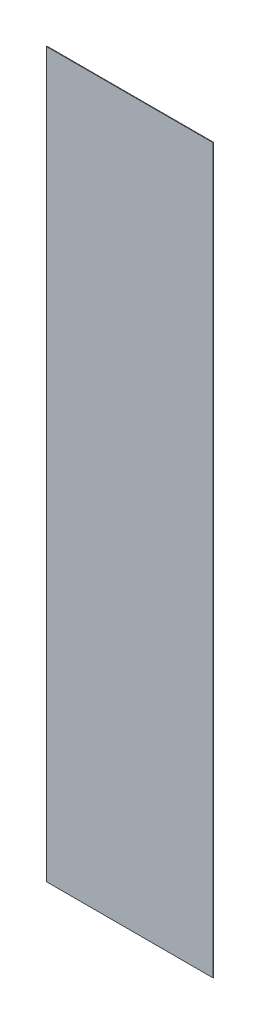
ISO-10303-21;
HEADER;
FILE_DESCRIPTION(('STEP AP214'),'2;1');
FILE_NAME('part.step','',(''),(''),'','','');
FILE_SCHEMA(('AUTOMOTIVE_DESIGN { 1 0 10303 214 1 1 1 1 }'));
ENDSEC;
DATA;
#1=APPLICATION_CONTEXT('core data for automotive mechanical design processes');
#2=APPLICATION_PROTOCOL_DEFINITION('international standard','automotive_design',2000,#1);
#3=PRODUCT_CONTEXT('',#1,'mechanical');
#4=PRODUCT('Part','Part','',(#3));
#5=PRODUCT_RELATED_PRODUCT_CATEGORY('part','',(#4));
#6=PRODUCT_DEFINITION_FORMATION('','',#4);
#7=PRODUCT_DEFINITION_CONTEXT('part definition',#1,'design');
#8=PRODUCT_DEFINITION('design','',#6,#7);
#9=PRODUCT_DEFINITION_SHAPE('','',#8);
#10=(LENGTH_UNIT() NAMED_UNIT(*) SI_UNIT(.MILLI.,.METRE.));
#11=(NAMED_UNIT(*) PLANE_ANGLE_UNIT() SI_UNIT($,.RADIAN.));
#12=(NAMED_UNIT(*) SI_UNIT($,.STERADIAN.) SOLID_ANGLE_UNIT());
#13=UNCERTAINTY_MEASURE_WITH_UNIT(LENGTH_MEASURE(1.E-05),#10,'distance_accuracy_value','');
#14=(GEOMETRIC_REPRESENTATION_CONTEXT(3) GLOBAL_UNCERTAINTY_ASSIGNED_CONTEXT((#13)) GLOBAL_UNIT_ASSIGNED_CONTEXT((#10,
#11,#12)) REPRESENTATION_CONTEXT('',''));
#15=CARTESIAN_POINT('',(0.,0.,0.));
#16=DIRECTION('',(0.,0.,1.));
#17=DIRECTION('',(1.,0.,0.));
#18=AXIS2_PLACEMENT_3D('',#15,#16,#17);
#19=CARTESIAN_POINT('',(1.49999954,-6.4999997,0.00999998));
#20=DIRECTION('',(0.,0.,1.));
#21=DIRECTION('',(1.,0.,0.));
#22=AXIS2_PLACEMENT_3D('',#19,#20,#21);
#23=PLANE('',#22);
#24=DIRECTION('',(0.,-1.,0.));
#25=VECTOR('',#24,1.);
#26=CARTESIAN_POINT('',(1.49999954,6.4999997,0.00999998));
#27=LINE('',#26,#25);
#28=CARTESIAN_POINT('',(1.49999954,6.4999997,0.00999998));
#29=VERTEX_POINT('',#28);
#30=CARTESIAN_POINT('',(1.49999954,-6.4999997,0.00999998));
#31=VERTEX_POINT('',#30);
#32=EDGE_CURVE('E21',#29,#31,#27,.T.);
#33=ORIENTED_EDGE('',*,*,#32,.F.);
#34=DIRECTION('',(1.,0.,0.));
#35=VECTOR('',#34,1.);
#36=CARTESIAN_POINT('',(-1.49999954,6.4999997,0.00999998));
#37=LINE('',#36,#35);
#38=CARTESIAN_POINT('',(-1.49999954,6.4999997,0.00999998));
#39=VERTEX_POINT('',#38);
#40=EDGE_CURVE('E66',#39,#29,#37,.T.);
#41=ORIENTED_EDGE('',*,*,#40,.F.);
#42=DIRECTION('',(0.,1.,0.));
#43=VECTOR('',#42,1.);
#44=CARTESIAN_POINT('',(-1.49999954,-6.4999997,0.00999998));
#45=LINE('',#44,#43);
#46=CARTESIAN_POINT('',(-1.49999954,-6.4999997,0.00999998));
#47=VERTEX_POINT('',#46);
#48=EDGE_CURVE('E70',#47,#39,#45,.T.);
#49=ORIENTED_EDGE('',*,*,#48,.F.);
#50=DIRECTION('',(-1.,0.,0.));
#51=VECTOR('',#50,1.);
#52=CARTESIAN_POINT('',(1.49999954,-6.4999997,0.00999998));
#53=LINE('',#52,#51);
#54=EDGE_CURVE('E102',#31,#47,#53,.T.);
#55=ORIENTED_EDGE('',*,*,#54,.F.);
#56=EDGE_LOOP('',(#33,#41,#49,#55));
#57=FACE_BOUND('',#56,.T.);
#58=ADVANCED_FACE('F17',(#57),#23,.T.);
#59=CARTESIAN_POINT('',(1.49999954,-6.4999997,0.));
#60=DIRECTION('',(0.,0.,1.));
#61=DIRECTION('',(1.,0.,0.));
#62=AXIS2_PLACEMENT_3D('',#59,#60,#61);
#63=PLANE('',#62);
#64=DIRECTION('',(-1.,0.,0.));
#65=VECTOR('',#64,1.);
#66=CARTESIAN_POINT('',(1.49999954,-6.4999997,0.));
#67=LINE('',#66,#65);
#68=CARTESIAN_POINT('',(1.49999954,-6.4999997,0.));
#69=VERTEX_POINT('',#68);
#70=CARTESIAN_POINT('',(-1.49999954,-6.4999997,0.));
#71=VERTEX_POINT('',#70);
#72=EDGE_CURVE('E91',#69,#71,#67,.T.);
#73=ORIENTED_EDGE('',*,*,#72,.T.);
#74=DIRECTION('',(0.,1.,0.));
#75=VECTOR('',#74,1.);
#76=CARTESIAN_POINT('',(-1.49999954,-6.4999997,0.));
#77=LINE('',#76,#75);
#78=CARTESIAN_POINT('',(-1.49999954,6.4999997,0.));
#79=VERTEX_POINT('',#78);
#80=EDGE_CURVE('E76',#71,#79,#77,.T.);
#81=ORIENTED_EDGE('',*,*,#80,.T.);
#82=DIRECTION('',(1.,0.,0.));
#83=VECTOR('',#82,1.);
#84=CARTESIAN_POINT('',(-1.49999954,6.4999997,0.));
#85=LINE('',#84,#83);
#86=CARTESIAN_POINT('',(1.49999954,6.4999997,0.));
#87=VERTEX_POINT('',#86);
#88=EDGE_CURVE('E81',#79,#87,#85,.T.);
#89=ORIENTED_EDGE('',*,*,#88,.T.);
#90=DIRECTION('',(0.,-1.,0.));
#91=VECTOR('',#90,1.);
#92=CARTESIAN_POINT('',(1.49999954,6.4999997,0.));
#93=LINE('',#92,#91);
#94=EDGE_CURVE('E11',#87,#69,#93,.T.);
#95=ORIENTED_EDGE('',*,*,#94,.T.);
#96=EDGE_LOOP('',(#73,#81,#89,#95));
#97=FACE_BOUND('',#96,.T.);
#98=ADVANCED_FACE('F19',(#97),#63,.F.);
#99=CARTESIAN_POINT('',(1.49999954,6.4999997,0.));
#100=DIRECTION('',(1.,0.,0.));
#101=DIRECTION('',(0.,1.,0.));
#102=AXIS2_PLACEMENT_3D('',#99,#100,#101);
#103=PLANE('',#102);
#104=DIRECTION('',(0.,0.,1.));
#105=VECTOR('',#104,1.);
#106=CARTESIAN_POINT('',(1.49999954,6.4999997,0.));
#107=LINE('',#106,#105);
#108=EDGE_CURVE('E75',#87,#29,#107,.T.);
#109=ORIENTED_EDGE('',*,*,#108,.T.);
#110=ORIENTED_EDGE('',*,*,#32,.T.);
#111=DIRECTION('',(0.,0.,1.));
#112=VECTOR('',#111,1.);
#113=CARTESIAN_POINT('',(1.49999954,-6.4999997,0.));
#114=LINE('',#113,#112);
#115=EDGE_CURVE('E101',#69,#31,#114,.T.);
#116=ORIENTED_EDGE('',*,*,#115,.F.);
#117=ORIENTED_EDGE('',*,*,#94,.F.);
#118=EDGE_LOOP('',(#109,#110,#116,#117));
#119=FACE_BOUND('',#118,.T.);
#120=ADVANCED_FACE('F117',(#119),#103,.T.);
#121=CARTESIAN_POINT('',(-1.49999954,6.4999997,0.));
#122=DIRECTION('',(0.,1.,0.));
#123=DIRECTION('',(1.,0.,0.));
#124=AXIS2_PLACEMENT_3D('',#121,#122,#123);
#125=PLANE('',#124);
#126=DIRECTION('',(0.,0.,1.));
#127=VECTOR('',#126,1.);
#128=CARTESIAN_POINT('',(-1.49999954,6.4999997,0.));
#129=LINE('',#128,#127);
#130=EDGE_CURVE('E79',#79,#39,#129,.T.);
#131=ORIENTED_EDGE('',*,*,#130,.T.);
#132=ORIENTED_EDGE('',*,*,#40,.T.);
#133=ORIENTED_EDGE('',*,*,#108,.F.);
#134=ORIENTED_EDGE('',*,*,#88,.F.);
#135=EDGE_LOOP('',(#131,#132,#133,#134));
#136=FACE_BOUND('',#135,.T.);
#137=ADVANCED_FACE('F80',(#136),#125,.T.);
#138=CARTESIAN_POINT('',(-1.49999954,-6.4999997,0.));
#139=DIRECTION('',(-1.,0.,0.));
#140=DIRECTION('',(0.,0.,1.));
#141=AXIS2_PLACEMENT_3D('',#138,#139,#140);
#142=PLANE('',#141);
#143=DIRECTION('',(0.,0.,1.));
#144=VECTOR('',#143,1.);
#145=CARTESIAN_POINT('',(-1.49999954,-6.4999997,0.));
#146=LINE('',#145,#144);
#147=EDGE_CURVE('E88',#71,#47,#146,.T.);
#148=ORIENTED_EDGE('',*,*,#147,.T.);
#149=ORIENTED_EDGE('',*,*,#48,.T.);
#150=ORIENTED_EDGE('',*,*,#130,.F.);
#151=ORIENTED_EDGE('',*,*,#80,.F.);
#152=EDGE_LOOP('',(#148,#149,#150,#151));
#153=FACE_BOUND('',#152,.T.);
#154=ADVANCED_FACE('F86',(#153),#142,.T.);
#155=CARTESIAN_POINT('',(1.49999954,-6.4999997,0.));
#156=DIRECTION('',(0.,-1.,0.));
#157=DIRECTION('',(0.,0.,-1.));
#158=AXIS2_PLACEMENT_3D('',#155,#156,#157);
#159=PLANE('',#158);
#160=ORIENTED_EDGE('',*,*,#115,.T.);
#161=ORIENTED_EDGE('',*,*,#54,.T.);
#162=ORIENTED_EDGE('',*,*,#147,.F.);
#163=ORIENTED_EDGE('',*,*,#72,.F.);
#164=EDGE_LOOP('',(#160,#161,#162,#163));
#165=FACE_BOUND('',#164,.T.);
#166=ADVANCED_FACE('F121',(#165),#159,.T.);
#167=CLOSED_SHELL('',(#58,#98,#120,#137,#154,#166));
#168=MANIFOLD_SOLID_BREP('B1',#167);
#169=ADVANCED_BREP_SHAPE_REPRESENTATION('',(#18,#168),#14);
#170=SHAPE_DEFINITION_REPRESENTATION(#9,#169);
ENDSEC;
END-ISO-10303-21;
